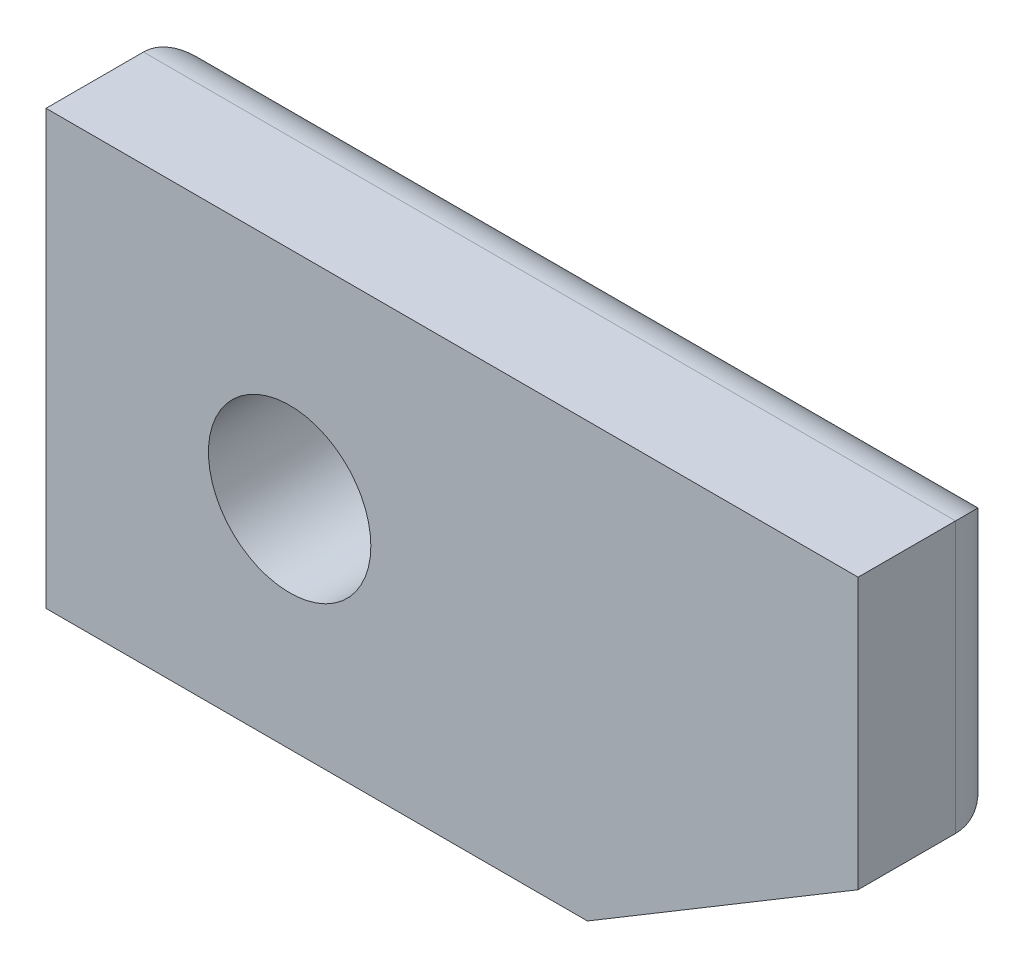
ISO-10303-21;
HEADER;
FILE_DESCRIPTION(('STEP AP214'),'2;1');
FILE_NAME('part.step','',(''),(''),'','','');
FILE_SCHEMA(('AUTOMOTIVE_DESIGN { 1 0 10303 214 1 1 1 1 }'));
ENDSEC;
DATA;
#1=APPLICATION_CONTEXT('core data for automotive mechanical design processes');
#2=APPLICATION_PROTOCOL_DEFINITION('international standard','automotive_design',2000,#1);
#3=PRODUCT_CONTEXT('',#1,'mechanical');
#4=PRODUCT('Part','Part','',(#3));
#5=PRODUCT_RELATED_PRODUCT_CATEGORY('part','',(#4));
#6=PRODUCT_DEFINITION_FORMATION('','',#4);
#7=PRODUCT_DEFINITION_CONTEXT('part definition',#1,'design');
#8=PRODUCT_DEFINITION('design','',#6,#7);
#9=PRODUCT_DEFINITION_SHAPE('','',#8);
#10=(LENGTH_UNIT() NAMED_UNIT(*) SI_UNIT(.MILLI.,.METRE.));
#11=(NAMED_UNIT(*) PLANE_ANGLE_UNIT() SI_UNIT($,.RADIAN.));
#12=(NAMED_UNIT(*) SI_UNIT($,.STERADIAN.) SOLID_ANGLE_UNIT());
#13=UNCERTAINTY_MEASURE_WITH_UNIT(LENGTH_MEASURE(1.E-05),#10,'distance_accuracy_value','');
#14=(GEOMETRIC_REPRESENTATION_CONTEXT(3) GLOBAL_UNCERTAINTY_ASSIGNED_CONTEXT((#13)) GLOBAL_UNIT_ASSIGNED_CONTEXT((#10,
#11,#12)) REPRESENTATION_CONTEXT('',''));
#15=CARTESIAN_POINT('',(0.,0.,0.));
#16=DIRECTION('',(0.,0.,1.));
#17=DIRECTION('',(1.,0.,0.));
#18=AXIS2_PLACEMENT_3D('',#15,#16,#17);
#19=CARTESIAN_POINT('',(0.,0.,1.4));
#20=DIRECTION('',(0.,0.,1.));
#21=DIRECTION('',(1.,0.,0.));
#22=AXIS2_PLACEMENT_3D('',#19,#20,#21);
#23=PLANE('',#22);
#24=DIRECTION('',(-1.,0.,0.));
#25=VECTOR('',#24,1.);
#26=CARTESIAN_POINT('',(5.25,2.,1.4));
#27=LINE('',#26,#25);
#28=CARTESIAN_POINT('',(5.25,2.,1.4));
#29=VERTEX_POINT('',#28);
#30=CARTESIAN_POINT('',(-2.25,2.,1.4));
#31=VERTEX_POINT('',#30);
#32=EDGE_CURVE('E118',#29,#31,#27,.T.);
#33=ORIENTED_EDGE('',*,*,#32,.T.);
#34=DIRECTION('',(0.,-1.,0.));
#35=VECTOR('',#34,1.);
#36=CARTESIAN_POINT('',(-2.25,2.,1.4));
#37=LINE('',#36,#35);
#38=CARTESIAN_POINT('',(-2.25,-2.,1.4));
#39=VERTEX_POINT('',#38);
#40=EDGE_CURVE('E105',#31,#39,#37,.T.);
#41=ORIENTED_EDGE('',*,*,#40,.T.);
#42=DIRECTION('',(1.,0.,0.));
#43=VECTOR('',#42,1.);
#44=CARTESIAN_POINT('',(-2.25,-2.,1.4));
#45=LINE('',#44,#43);
#46=CARTESIAN_POINT('',(2.75,-2.,1.4));
#47=VERTEX_POINT('',#46);
#48=EDGE_CURVE('E117',#39,#47,#45,.T.);
#49=ORIENTED_EDGE('',*,*,#48,.T.);
#50=DIRECTION('',(0.857492925712544,0.514495755427527,0.));
#51=VECTOR('',#50,1.);
#52=CARTESIAN_POINT('',(2.75,-2.,1.4));
#53=LINE('',#52,#51);
#54=CARTESIAN_POINT('',(5.25,-0.5,1.4));
#55=VERTEX_POINT('',#54);
#56=EDGE_CURVE('E195',#47,#55,#53,.T.);
#57=ORIENTED_EDGE('',*,*,#56,.T.);
#58=DIRECTION('',(0.,1.,0.));
#59=VECTOR('',#58,1.);
#60=CARTESIAN_POINT('',(5.25,-0.5,1.4));
#61=LINE('',#60,#59);
#62=EDGE_CURVE('E123',#55,#29,#61,.T.);
#63=ORIENTED_EDGE('',*,*,#62,.T.);
#64=EDGE_LOOP('',(#33,#41,#49,#57,#63));
#65=FACE_BOUND('',#64,.T.);
#66=CARTESIAN_POINT('',(0.,0.,1.4));
#67=DIRECTION('',(0.,0.,1.));
#68=DIRECTION('',(1.,0.,0.));
#69=AXIS2_PLACEMENT_3D('',#66,#67,#68);
#70=CIRCLE('',#69,0.75);
#71=CARTESIAN_POINT('',(0.75,0.,1.4));
#72=VERTEX_POINT('',#71);
#73=EDGE_CURVE('E126',#72,#72,#70,.T.);
#74=ORIENTED_EDGE('',*,*,#73,.F.);
#75=EDGE_LOOP('',(#74));
#76=FACE_BOUND('',#75,.T.);
#77=ADVANCED_FACE('F39',(#65,#76),#23,.T.);
#78=CARTESIAN_POINT('',(0.,0.,0.));
#79=DIRECTION('',(0.,0.,1.));
#80=DIRECTION('',(1.,0.,0.));
#81=AXIS2_PLACEMENT_3D('',#78,#79,#80);
#82=PLANE('',#81);
#83=DIRECTION('',(1.,0.,0.));
#84=VECTOR('',#83,1.);
#85=CARTESIAN_POINT('',(0.,-1.5,0.));
#86=LINE('',#85,#84);
#87=CARTESIAN_POINT('',(2.61150801752578,-1.5,0.));
#88=VERTEX_POINT('',#87);
#89=CARTESIAN_POINT('',(-1.75,-1.5,0.));
#90=VERTEX_POINT('',#89);
#91=EDGE_CURVE('E149',#88,#90,#86,.F.);
#92=ORIENTED_EDGE('',*,*,#91,.T.);
#93=DIRECTION('',(0.,-1.,0.));
#94=VECTOR('',#93,1.);
#95=CARTESIAN_POINT('',(-1.75,0.,0.));
#96=LINE('',#95,#94);
#97=CARTESIAN_POINT('',(-1.75,1.5,0.));
#98=VERTEX_POINT('',#97);
#99=EDGE_CURVE('E152',#90,#98,#96,.F.);
#100=ORIENTED_EDGE('',*,*,#99,.T.);
#101=DIRECTION('',(-1.,0.,0.));
#102=VECTOR('',#101,1.);
#103=CARTESIAN_POINT('',(0.,1.5,0.));
#104=LINE('',#103,#102);
#105=CARTESIAN_POINT('',(4.75,1.5,0.));
#106=VERTEX_POINT('',#105);
#107=EDGE_CURVE('E135',#98,#106,#104,.F.);
#108=ORIENTED_EDGE('',*,*,#107,.T.);
#109=DIRECTION('',(0.,1.,0.));
#110=VECTOR('',#109,1.);
#111=CARTESIAN_POINT('',(4.75,0.,0.));
#112=LINE('',#111,#110);
#113=CARTESIAN_POINT('',(4.75,-0.216904810515471,0.));
#114=VERTEX_POINT('',#113);
#115=EDGE_CURVE('E143',#106,#114,#112,.F.);
#116=ORIENTED_EDGE('',*,*,#115,.T.);
#117=DIRECTION('',(0.857492925712544,0.514495755427527,0.));
#118=VECTOR('',#117,1.);
#119=CARTESIAN_POINT('',(1.3530462399333,-2.25507706655549,0.));
#120=LINE('',#119,#118);
#121=EDGE_CURVE('E146',#114,#88,#120,.F.);
#122=ORIENTED_EDGE('',*,*,#121,.T.);
#123=EDGE_LOOP('',(#92,#100,#108,#116,#122));
#124=FACE_BOUND('',#123,.T.);
#125=CARTESIAN_POINT('',(0.,0.,0.));
#126=DIRECTION('',(0.,0.,1.));
#127=DIRECTION('',(1.,0.,0.));
#128=AXIS2_PLACEMENT_3D('',#125,#126,#127);
#129=CIRCLE('',#128,0.75);
#130=CARTESIAN_POINT('',(0.75,0.,0.));
#131=VERTEX_POINT('',#130);
#132=EDGE_CURVE('E180',#131,#131,#129,.T.);
#133=ORIENTED_EDGE('',*,*,#132,.T.);
#134=EDGE_LOOP('',(#133));
#135=FACE_BOUND('',#134,.T.);
#136=ADVANCED_FACE('F219',(#124,#135),#82,.F.);
#137=CARTESIAN_POINT('',(5.25,2.,1.4));
#138=DIRECTION('',(0.,-1.,0.));
#139=DIRECTION('',(0.,0.,-1.));
#140=AXIS2_PLACEMENT_3D('',#137,#138,#139);
#141=PLANE('',#140);
#142=DIRECTION('',(0.,0.,-1.));
#143=VECTOR('',#142,1.);
#144=CARTESIAN_POINT('',(5.25,2.,1.4));
#145=LINE('',#144,#143);
#146=CARTESIAN_POINT('',(5.25,2.,0.5));
#147=VERTEX_POINT('',#146);
#148=EDGE_CURVE('E200',#29,#147,#145,.T.);
#149=ORIENTED_EDGE('',*,*,#148,.T.);
#150=DIRECTION('',(-1.,0.,0.));
#151=VECTOR('',#150,1.);
#152=CARTESIAN_POINT('',(5.25,2.,0.5));
#153=LINE('',#152,#151);
#154=CARTESIAN_POINT('',(-2.25,2.,0.5));
#155=VERTEX_POINT('',#154);
#156=EDGE_CURVE('E11',#147,#155,#153,.T.);
#157=ORIENTED_EDGE('',*,*,#156,.T.);
#158=DIRECTION('',(0.,0.,-1.));
#159=VECTOR('',#158,1.);
#160=CARTESIAN_POINT('',(-2.25,2.,1.4));
#161=LINE('',#160,#159);
#162=EDGE_CURVE('E110',#31,#155,#161,.T.);
#163=ORIENTED_EDGE('',*,*,#162,.F.);
#164=ORIENTED_EDGE('',*,*,#32,.F.);
#165=EDGE_LOOP('',(#149,#157,#163,#164));
#166=FACE_BOUND('',#165,.T.);
#167=ADVANCED_FACE('F128',(#166),#141,.F.);
#168=CARTESIAN_POINT('',(-2.25,2.,1.4));
#169=DIRECTION('',(1.,0.,0.));
#170=DIRECTION('',(0.,0.,-1.));
#171=AXIS2_PLACEMENT_3D('',#168,#169,#170);
#172=PLANE('',#171);
#173=ORIENTED_EDGE('',*,*,#162,.T.);
#174=DIRECTION('',(0.,-1.,0.));
#175=VECTOR('',#174,1.);
#176=CARTESIAN_POINT('',(-2.25,2.,0.5));
#177=LINE('',#176,#175);
#178=CARTESIAN_POINT('',(-2.25,-2.,0.5));
#179=VERTEX_POINT('',#178);
#180=EDGE_CURVE('E131',#155,#179,#177,.T.);
#181=ORIENTED_EDGE('',*,*,#180,.T.);
#182=DIRECTION('',(0.,0.,-1.));
#183=VECTOR('',#182,1.);
#184=CARTESIAN_POINT('',(-2.25,-2.,1.4));
#185=LINE('',#184,#183);
#186=EDGE_CURVE('E113',#39,#179,#185,.T.);
#187=ORIENTED_EDGE('',*,*,#186,.F.);
#188=ORIENTED_EDGE('',*,*,#40,.F.);
#189=EDGE_LOOP('',(#173,#181,#187,#188));
#190=FACE_BOUND('',#189,.T.);
#191=ADVANCED_FACE('F107',(#190),#172,.F.);
#192=CARTESIAN_POINT('',(-2.25,-2.,1.4));
#193=DIRECTION('',(0.,1.,0.));
#194=DIRECTION('',(0.,0.,1.));
#195=AXIS2_PLACEMENT_3D('',#192,#193,#194);
#196=PLANE('',#195);
#197=ORIENTED_EDGE('',*,*,#186,.T.);
#198=DIRECTION('',(1.,0.,0.));
#199=VECTOR('',#198,1.);
#200=CARTESIAN_POINT('',(-2.25,-2.,0.5));
#201=LINE('',#200,#199);
#202=CARTESIAN_POINT('',(2.75,-2.,0.5));
#203=VERTEX_POINT('',#202);
#204=EDGE_CURVE('E156',#179,#203,#201,.T.);
#205=ORIENTED_EDGE('',*,*,#204,.T.);
#206=DIRECTION('',(0.,0.,-1.));
#207=VECTOR('',#206,1.);
#208=CARTESIAN_POINT('',(2.75,-2.,1.4));
#209=LINE('',#208,#207);
#210=EDGE_CURVE('E137',#47,#203,#209,.T.);
#211=ORIENTED_EDGE('',*,*,#210,.F.);
#212=ORIENTED_EDGE('',*,*,#48,.F.);
#213=EDGE_LOOP('',(#197,#205,#211,#212));
#214=FACE_BOUND('',#213,.T.);
#215=ADVANCED_FACE('F246',(#214),#196,.F.);
#216=CARTESIAN_POINT('',(2.75,-2.,1.4));
#217=DIRECTION('',(-0.514495755427526,0.857492925712544,0.));
#218=DIRECTION('',(-0.857492925712544,-0.514495755427527,0.));
#219=AXIS2_PLACEMENT_3D('',#216,#217,#218);
#220=PLANE('',#219);
#221=ORIENTED_EDGE('',*,*,#210,.T.);
#222=DIRECTION('',(0.857492925712544,0.514495755427527,0.));
#223=VECTOR('',#222,1.);
#224=CARTESIAN_POINT('',(2.75,-2.,0.5));
#225=LINE('',#224,#223);
#226=CARTESIAN_POINT('',(5.25,-0.5,0.5));
#227=VERTEX_POINT('',#226);
#228=EDGE_CURVE('E64',#203,#227,#225,.T.);
#229=ORIENTED_EDGE('',*,*,#228,.T.);
#230=DIRECTION('',(0.,0.,-1.));
#231=VECTOR('',#230,1.);
#232=CARTESIAN_POINT('',(5.25,-0.5,1.4));
#233=LINE('',#232,#231);
#234=EDGE_CURVE('E203',#55,#227,#233,.T.);
#235=ORIENTED_EDGE('',*,*,#234,.F.);
#236=ORIENTED_EDGE('',*,*,#56,.F.);
#237=EDGE_LOOP('',(#221,#229,#235,#236));
#238=FACE_BOUND('',#237,.T.);
#239=ADVANCED_FACE('F208',(#238),#220,.F.);
#240=CARTESIAN_POINT('',(5.25,-0.5,1.4));
#241=DIRECTION('',(-1.,0.,0.));
#242=DIRECTION('',(0.,0.,1.));
#243=AXIS2_PLACEMENT_3D('',#240,#241,#242);
#244=PLANE('',#243);
#245=ORIENTED_EDGE('',*,*,#234,.T.);
#246=DIRECTION('',(0.,1.,0.));
#247=VECTOR('',#246,1.);
#248=CARTESIAN_POINT('',(5.25,-0.5,0.5));
#249=LINE('',#248,#247);
#250=EDGE_CURVE('E49',#227,#147,#249,.T.);
#251=ORIENTED_EDGE('',*,*,#250,.T.);
#252=ORIENTED_EDGE('',*,*,#148,.F.);
#253=ORIENTED_EDGE('',*,*,#62,.F.);
#254=EDGE_LOOP('',(#245,#251,#252,#253));
#255=FACE_BOUND('',#254,.T.);
#256=ADVANCED_FACE('F232',(#255),#244,.F.);
#257=CARTESIAN_POINT('',(0.,0.,1.4));
#258=DIRECTION('',(0.,0.,-1.));
#259=DIRECTION('',(-1.,0.,0.));
#260=AXIS2_PLACEMENT_3D('',#257,#258,#259);
#261=CYLINDRICAL_SURFACE('',#260,0.75);
#262=ORIENTED_EDGE('',*,*,#73,.T.);
#263=EDGE_LOOP('',(#262));
#264=FACE_BOUND('',#263,.T.);
#265=ORIENTED_EDGE('',*,*,#132,.F.);
#266=EDGE_LOOP('',(#265));
#267=FACE_BOUND('',#266,.T.);
#268=ADVANCED_FACE('F227',(#264,#267),#261,.F.);
#269=CARTESIAN_POINT('',(4.75,-0.5,0.5));
#270=DIRECTION('',(0.,1.,0.));
#271=DIRECTION('',(0.,0.,1.));
#272=AXIS2_PLACEMENT_3D('',#269,#270,#271);
#273=CYLINDRICAL_SURFACE('',#272,0.5);
#274=CARTESIAN_POINT('',(4.75,1.5,0.5));
#275=DIRECTION('',(-0.707106781186547,0.707106781186547,0.));
#276=DIRECTION('',(-0.707106781186547,-0.707106781186547,0.));
#277=AXIS2_PLACEMENT_3D('',#274,#275,#276);
#278=ELLIPSE('',#277,0.707106781186547,0.5);
#279=EDGE_CURVE('E172',#147,#106,#278,.T.);
#280=ORIENTED_EDGE('',*,*,#279,.F.);
#281=ORIENTED_EDGE('',*,*,#250,.F.);
#282=CARTESIAN_POINT('',(4.75,-0.21690481051547,0.5));
#283=DIRECTION('',(0.492698814983593,0.870199906753479,0.));
#284=DIRECTION('',(-0.870199906753479,0.492698814983593,0.));
#285=AXIS2_PLACEMENT_3D('',#282,#283,#284);
#286=ELLIPSE('',#285,0.574580617763323,0.5);
#287=EDGE_CURVE('E43',#114,#227,#286,.F.);
#288=ORIENTED_EDGE('',*,*,#287,.F.);
#289=ORIENTED_EDGE('',*,*,#115,.F.);
#290=EDGE_LOOP('',(#280,#281,#288,#289));
#291=FACE_BOUND('',#290,.T.);
#292=ADVANCED_FACE('F41',(#291),#273,.T.);
#293=CARTESIAN_POINT('',(2.49275212228624,-1.57125353714373,0.5));
#294=DIRECTION('',(0.857492925712544,0.514495755427527,0.));
#295=DIRECTION('',(-0.514495755427526,0.857492925712544,0.));
#296=AXIS2_PLACEMENT_3D('',#293,#294,#295);
#297=CYLINDRICAL_SURFACE('',#296,0.5);
#298=ORIENTED_EDGE('',*,*,#287,.T.);
#299=ORIENTED_EDGE('',*,*,#228,.F.);
#300=CARTESIAN_POINT('',(2.61150801752578,-1.5,0.5));
#301=DIRECTION('',(0.963714928210761,0.266933581895812,0.));
#302=DIRECTION('',(-0.266933581895811,0.963714928210761,0.));
#303=AXIS2_PLACEMENT_3D('',#300,#301,#302);
#304=ELLIPSE('',#303,0.518825625051075,0.5);
#305=EDGE_CURVE('E169',#88,#203,#304,.F.);
#306=ORIENTED_EDGE('',*,*,#305,.F.);
#307=ORIENTED_EDGE('',*,*,#121,.F.);
#308=EDGE_LOOP('',(#298,#299,#306,#307));
#309=FACE_BOUND('',#308,.T.);
#310=ADVANCED_FACE('F211',(#309),#297,.T.);
#311=CARTESIAN_POINT('',(5.25,1.5,0.5));
#312=DIRECTION('',(-1.,0.,0.));
#313=DIRECTION('',(0.,0.,1.));
#314=AXIS2_PLACEMENT_3D('',#311,#312,#313);
#315=CYLINDRICAL_SURFACE('',#314,0.5);
#316=ORIENTED_EDGE('',*,*,#279,.T.);
#317=ORIENTED_EDGE('',*,*,#107,.F.);
#318=CARTESIAN_POINT('',(-1.75,1.5,0.5));
#319=DIRECTION('',(-0.707106781186547,-0.707106781186547,0.));
#320=DIRECTION('',(-0.707106781186547,0.707106781186547,0.));
#321=AXIS2_PLACEMENT_3D('',#318,#319,#320);
#322=ELLIPSE('',#321,0.707106781186547,0.5);
#323=EDGE_CURVE('E166',#155,#98,#322,.T.);
#324=ORIENTED_EDGE('',*,*,#323,.F.);
#325=ORIENTED_EDGE('',*,*,#156,.F.);
#326=EDGE_LOOP('',(#316,#317,#324,#325));
#327=FACE_BOUND('',#326,.T.);
#328=ADVANCED_FACE('F223',(#327),#315,.T.);
#329=CARTESIAN_POINT('',(-2.25,-1.5,0.5));
#330=DIRECTION('',(1.,0.,0.));
#331=DIRECTION('',(0.,0.,-1.));
#332=AXIS2_PLACEMENT_3D('',#329,#330,#331);
#333=CYLINDRICAL_SURFACE('',#332,0.5);
#334=ORIENTED_EDGE('',*,*,#305,.T.);
#335=ORIENTED_EDGE('',*,*,#204,.F.);
#336=CARTESIAN_POINT('',(-1.75,-1.5,0.5));
#337=DIRECTION('',(0.707106781186547,-0.707106781186547,0.));
#338=DIRECTION('',(0.707106781186547,0.707106781186547,0.));
#339=AXIS2_PLACEMENT_3D('',#336,#337,#338);
#340=ELLIPSE('',#339,0.707106781186547,0.5);
#341=EDGE_CURVE('E163',#90,#179,#340,.F.);
#342=ORIENTED_EDGE('',*,*,#341,.F.);
#343=ORIENTED_EDGE('',*,*,#91,.F.);
#344=EDGE_LOOP('',(#334,#335,#342,#343));
#345=FACE_BOUND('',#344,.T.);
#346=ADVANCED_FACE('F215',(#345),#333,.T.);
#347=CARTESIAN_POINT('',(-1.75,2.,0.5));
#348=DIRECTION('',(0.,-1.,0.));
#349=DIRECTION('',(0.,0.,-1.));
#350=AXIS2_PLACEMENT_3D('',#347,#348,#349);
#351=CYLINDRICAL_SURFACE('',#350,0.5);
#352=ORIENTED_EDGE('',*,*,#323,.T.);
#353=ORIENTED_EDGE('',*,*,#99,.F.);
#354=ORIENTED_EDGE('',*,*,#341,.T.);
#355=ORIENTED_EDGE('',*,*,#180,.F.);
#356=EDGE_LOOP('',(#352,#353,#354,#355));
#357=FACE_BOUND('',#356,.T.);
#358=ADVANCED_FACE('F221',(#357),#351,.T.);
#359=CLOSED_SHELL('',(#77,#136,#167,#191,#215,#239,#256,#268,#292,#310,#328,#346,#358));
#360=MANIFOLD_SOLID_BREP('B2',#359);
#361=ADVANCED_BREP_SHAPE_REPRESENTATION('',(#18,#360),#14);
#362=SHAPE_DEFINITION_REPRESENTATION(#9,#361);
ENDSEC;
END-ISO-10303-21;
